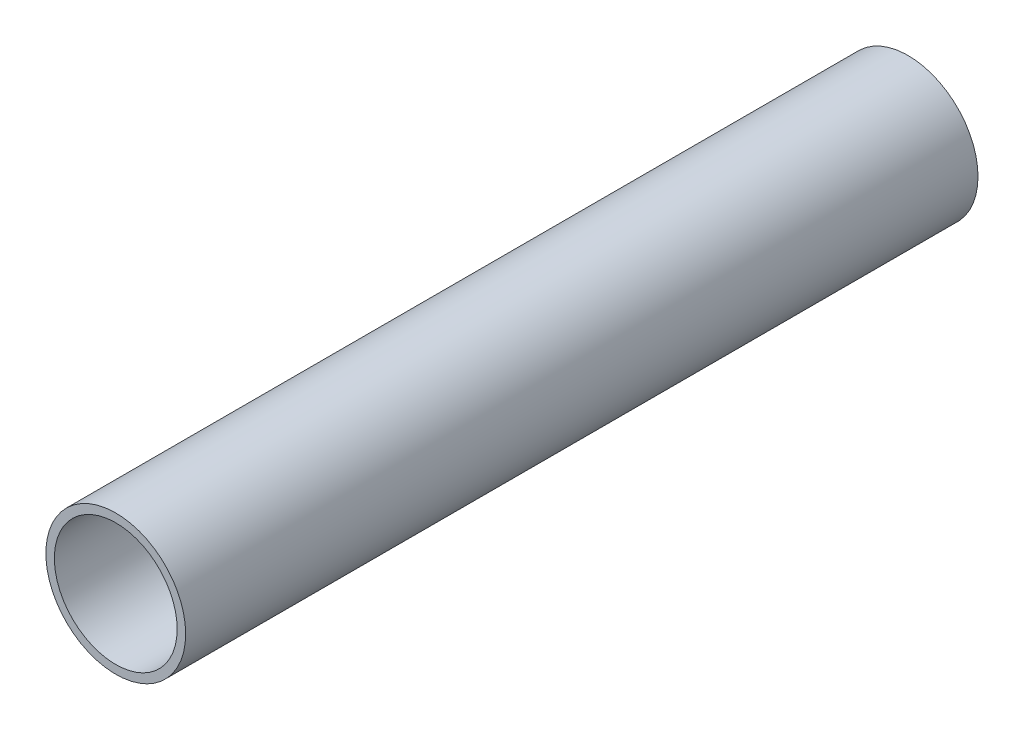
ISO-10303-21;
HEADER;
FILE_DESCRIPTION(('STEP AP214'),'2;1');
FILE_NAME('part.step','',(''),(''),'','','');
FILE_SCHEMA(('AUTOMOTIVE_DESIGN { 1 0 10303 214 1 1 1 1 }'));
ENDSEC;
DATA;
#1=APPLICATION_CONTEXT('core data for automotive mechanical design processes');
#2=APPLICATION_PROTOCOL_DEFINITION('international standard','automotive_design',2000,#1);
#3=PRODUCT_CONTEXT('',#1,'mechanical');
#4=PRODUCT('Part','Part','',(#3));
#5=PRODUCT_RELATED_PRODUCT_CATEGORY('part','',(#4));
#6=PRODUCT_DEFINITION_FORMATION('','',#4);
#7=PRODUCT_DEFINITION_CONTEXT('part definition',#1,'design');
#8=PRODUCT_DEFINITION('design','',#6,#7);
#9=PRODUCT_DEFINITION_SHAPE('','',#8);
#10=(LENGTH_UNIT() NAMED_UNIT(*) SI_UNIT(.MILLI.,.METRE.));
#11=(NAMED_UNIT(*) PLANE_ANGLE_UNIT() SI_UNIT($,.RADIAN.));
#12=(NAMED_UNIT(*) SI_UNIT($,.STERADIAN.) SOLID_ANGLE_UNIT());
#13=UNCERTAINTY_MEASURE_WITH_UNIT(LENGTH_MEASURE(1.E-05),#10,'distance_accuracy_value','');
#14=(GEOMETRIC_REPRESENTATION_CONTEXT(3) GLOBAL_UNCERTAINTY_ASSIGNED_CONTEXT((#13)) GLOBAL_UNIT_ASSIGNED_CONTEXT((#10,
#11,#12)) REPRESENTATION_CONTEXT('',''));
#15=CARTESIAN_POINT('',(0.,0.,0.));
#16=DIRECTION('',(0.,0.,1.));
#17=DIRECTION('',(1.,0.,0.));
#18=AXIS2_PLACEMENT_3D('',#15,#16,#17);
#19=CARTESIAN_POINT('',(0.,0.,140.));
#20=DIRECTION('',(0.,0.,1.));
#21=DIRECTION('',(1.,0.,0.));
#22=AXIS2_PLACEMENT_3D('',#19,#20,#21);
#23=PLANE('',#22);
#24=CARTESIAN_POINT('',(0.,0.,140.));
#25=DIRECTION('',(0.,0.,1.));
#26=DIRECTION('',(1.,0.,0.));
#27=AXIS2_PLACEMENT_3D('',#24,#25,#26);
#28=CIRCLE('',#27,12.35);
#29=CARTESIAN_POINT('',(12.35,0.,140.));
#30=VERTEX_POINT('',#29);
#31=EDGE_CURVE('E10',#30,#30,#28,.T.);
#32=ORIENTED_EDGE('',*,*,#31,.T.);
#33=EDGE_LOOP('',(#32));
#34=FACE_BOUND('',#33,.T.);
#35=CARTESIAN_POINT('',(0.,0.,140.));
#36=DIRECTION('',(0.,0.,1.));
#37=DIRECTION('',(1.,0.,0.));
#38=AXIS2_PLACEMENT_3D('',#35,#36,#37);
#39=CIRCLE('',#38,10.85);
#40=CARTESIAN_POINT('',(10.85,0.,140.));
#41=VERTEX_POINT('',#40);
#42=EDGE_CURVE('E42',#41,#41,#39,.T.);
#43=ORIENTED_EDGE('',*,*,#42,.F.);
#44=EDGE_LOOP('',(#43));
#45=FACE_BOUND('',#44,.T.);
#46=ADVANCED_FACE('F31',(#34,#45),#23,.T.);
#47=CARTESIAN_POINT('',(0.,0.,0.));
#48=DIRECTION('',(0.,0.,1.));
#49=DIRECTION('',(1.,0.,0.));
#50=AXIS2_PLACEMENT_3D('',#47,#48,#49);
#51=PLANE('',#50);
#52=CARTESIAN_POINT('',(0.,0.,0.));
#53=DIRECTION('',(0.,0.,1.));
#54=DIRECTION('',(1.,0.,0.));
#55=AXIS2_PLACEMENT_3D('',#52,#53,#54);
#56=CIRCLE('',#55,12.35);
#57=CARTESIAN_POINT('',(12.35,0.,0.));
#58=VERTEX_POINT('',#57);
#59=EDGE_CURVE('E35',#58,#58,#56,.T.);
#60=ORIENTED_EDGE('',*,*,#59,.F.);
#61=EDGE_LOOP('',(#60));
#62=FACE_BOUND('',#61,.T.);
#63=CARTESIAN_POINT('',(0.,0.,0.));
#64=DIRECTION('',(0.,0.,1.));
#65=DIRECTION('',(1.,0.,0.));
#66=AXIS2_PLACEMENT_3D('',#63,#64,#65);
#67=CIRCLE('',#66,10.85);
#68=CARTESIAN_POINT('',(10.85,0.,0.));
#69=VERTEX_POINT('',#68);
#70=EDGE_CURVE('E44',#69,#69,#67,.T.);
#71=ORIENTED_EDGE('',*,*,#70,.T.);
#72=EDGE_LOOP('',(#71));
#73=FACE_BOUND('',#72,.T.);
#74=ADVANCED_FACE('F54',(#62,#73),#51,.F.);
#75=CARTESIAN_POINT('',(0.,0.,140.));
#76=DIRECTION('',(0.,0.,-1.));
#77=DIRECTION('',(-1.,0.,0.));
#78=AXIS2_PLACEMENT_3D('',#75,#76,#77);
#79=CYLINDRICAL_SURFACE('',#78,12.35);
#80=ORIENTED_EDGE('',*,*,#31,.F.);
#81=EDGE_LOOP('',(#80));
#82=FACE_BOUND('',#81,.T.);
#83=ORIENTED_EDGE('',*,*,#59,.T.);
#84=EDGE_LOOP('',(#83));
#85=FACE_BOUND('',#84,.T.);
#86=ADVANCED_FACE('F33',(#82,#85),#79,.T.);
#87=CARTESIAN_POINT('',(0.,0.,140.));
#88=DIRECTION('',(0.,0.,-1.));
#89=DIRECTION('',(-1.,0.,0.));
#90=AXIS2_PLACEMENT_3D('',#87,#88,#89);
#91=CYLINDRICAL_SURFACE('',#90,10.85);
#92=ORIENTED_EDGE('',*,*,#42,.T.);
#93=EDGE_LOOP('',(#92));
#94=FACE_BOUND('',#93,.T.);
#95=ORIENTED_EDGE('',*,*,#70,.F.);
#96=EDGE_LOOP('',(#95));
#97=FACE_BOUND('',#96,.T.);
#98=ADVANCED_FACE('F50',(#94,#97),#91,.F.);
#99=CLOSED_SHELL('',(#46,#74,#86,#98));
#100=MANIFOLD_SOLID_BREP('B2',#99);
#101=ADVANCED_BREP_SHAPE_REPRESENTATION('',(#18,#100),#14);
#102=SHAPE_DEFINITION_REPRESENTATION(#9,#101);
ENDSEC;
END-ISO-10303-21;
